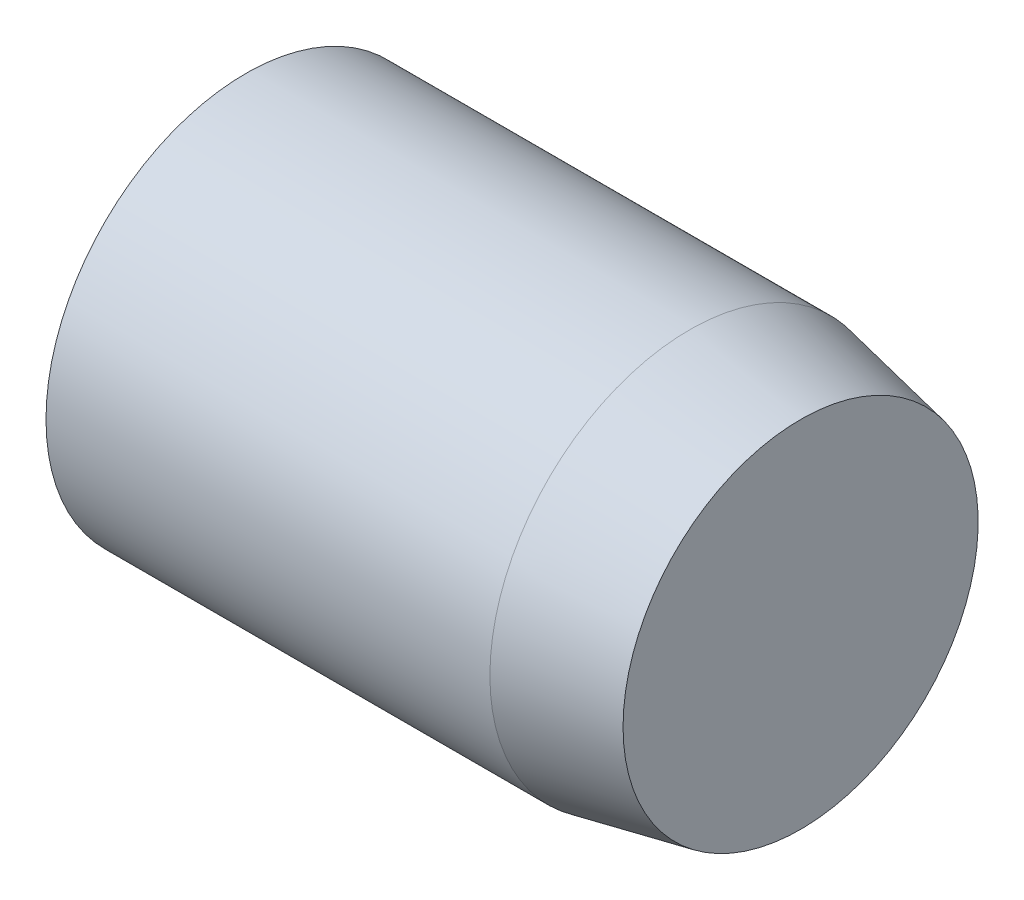
ISO-10303-21;
HEADER;
FILE_DESCRIPTION(('STEP AP214'),'2;1');
FILE_NAME('part.step','',(''),(''),'','','');
FILE_SCHEMA(('AUTOMOTIVE_DESIGN { 1 0 10303 214 1 1 1 1 }'));
ENDSEC;
DATA;
#1=APPLICATION_CONTEXT('core data for automotive mechanical design processes');
#2=APPLICATION_PROTOCOL_DEFINITION('international standard','automotive_design',2000,#1);
#3=PRODUCT_CONTEXT('',#1,'mechanical');
#4=PRODUCT('Part','Part','',(#3));
#5=PRODUCT_RELATED_PRODUCT_CATEGORY('part','',(#4));
#6=PRODUCT_DEFINITION_FORMATION('','',#4);
#7=PRODUCT_DEFINITION_CONTEXT('part definition',#1,'design');
#8=PRODUCT_DEFINITION('design','',#6,#7);
#9=PRODUCT_DEFINITION_SHAPE('','',#8);
#10=(LENGTH_UNIT() NAMED_UNIT(*) SI_UNIT(.MILLI.,.METRE.));
#11=(NAMED_UNIT(*) PLANE_ANGLE_UNIT() SI_UNIT($,.RADIAN.));
#12=(NAMED_UNIT(*) SI_UNIT($,.STERADIAN.) SOLID_ANGLE_UNIT());
#13=UNCERTAINTY_MEASURE_WITH_UNIT(LENGTH_MEASURE(1.E-05),#10,'distance_accuracy_value','');
#14=(GEOMETRIC_REPRESENTATION_CONTEXT(3) GLOBAL_UNCERTAINTY_ASSIGNED_CONTEXT((#13)) GLOBAL_UNIT_ASSIGNED_CONTEXT((#10,
#11,#12)) REPRESENTATION_CONTEXT('',''));
#15=CARTESIAN_POINT('',(0.,0.,0.));
#16=DIRECTION('',(0.,0.,1.));
#17=DIRECTION('',(1.,0.,0.));
#18=AXIS2_PLACEMENT_3D('',#15,#16,#17);
#19=CARTESIAN_POINT('',(0.,0.,0.));
#20=DIRECTION('',(-1.,0.,0.));
#21=DIRECTION('',(0.,0.,1.));
#22=AXIS2_PLACEMENT_3D('',#19,#20,#21);
#23=CYLINDRICAL_SURFACE('',#22,4.5);
#24=CARTESIAN_POINT('',(0.,0.,0.));
#25=DIRECTION('',(-1.,0.,0.));
#26=DIRECTION('',(0.,0.,1.));
#27=AXIS2_PLACEMENT_3D('',#24,#25,#26);
#28=CIRCLE('',#27,4.5);
#29=CARTESIAN_POINT('',(0.,0.,4.5));
#30=VERTEX_POINT('',#29);
#31=EDGE_CURVE('E10',#30,#30,#28,.T.);
#32=ORIENTED_EDGE('',*,*,#31,.F.);
#33=EDGE_LOOP('',(#32));
#34=FACE_BOUND('',#33,.T.);
#35=CARTESIAN_POINT('',(10.,0.,0.));
#36=DIRECTION('',(-1.,0.,0.));
#37=DIRECTION('',(0.,0.,1.));
#38=AXIS2_PLACEMENT_3D('',#35,#36,#37);
#39=CIRCLE('',#38,4.5);
#40=CARTESIAN_POINT('',(10.,0.,4.5));
#41=VERTEX_POINT('',#40);
#42=EDGE_CURVE('E49',#41,#41,#39,.T.);
#43=ORIENTED_EDGE('',*,*,#42,.T.);
#44=EDGE_LOOP('',(#43));
#45=FACE_BOUND('',#44,.T.);
#46=ADVANCED_FACE('F37',(#34,#45),#23,.T.);
#47=CARTESIAN_POINT('',(0.,0.,-4.5));
#48=DIRECTION('',(1.,0.,0.));
#49=DIRECTION('',(0.,0.,-1.));
#50=AXIS2_PLACEMENT_3D('',#47,#48,#49);
#51=PLANE('',#50);
#52=ORIENTED_EDGE('',*,*,#31,.T.);
#53=EDGE_LOOP('',(#52));
#54=FACE_BOUND('',#53,.T.);
#55=ADVANCED_FACE('F65',(#54),#51,.F.);
#56=CARTESIAN_POINT('',(12.5,0.,0.));
#57=DIRECTION('',(-1.,0.,0.));
#58=DIRECTION('',(0.,0.,1.));
#59=AXIS2_PLACEMENT_3D('',#56,#57,#58);
#60=PLANE('',#59);
#61=CARTESIAN_POINT('',(12.5,0.,0.));
#62=DIRECTION('',(-1.,0.,0.));
#63=DIRECTION('',(0.,0.,1.));
#64=AXIS2_PLACEMENT_3D('',#61,#62,#63);
#65=CIRCLE('',#64,4.);
#66=CARTESIAN_POINT('',(12.5,0.,4.));
#67=VERTEX_POINT('',#66);
#68=EDGE_CURVE('E44',#67,#67,#65,.T.);
#69=ORIENTED_EDGE('',*,*,#68,.F.);
#70=EDGE_LOOP('',(#69));
#71=FACE_BOUND('',#70,.T.);
#72=ADVANCED_FACE('F60',(#71),#60,.F.);
#73=CARTESIAN_POINT('',(12.5,0.,0.));
#74=DIRECTION('',(-1.,0.,0.));
#75=DIRECTION('',(0.,0.,1.));
#76=AXIS2_PLACEMENT_3D('',#73,#74,#75);
#77=CONICAL_SURFACE('',#76,4.,0.197395559849881);
#78=ORIENTED_EDGE('',*,*,#42,.F.);
#79=EDGE_LOOP('',(#78));
#80=FACE_BOUND('',#79,.T.);
#81=ORIENTED_EDGE('',*,*,#68,.T.);
#82=EDGE_LOOP('',(#81));
#83=FACE_BOUND('',#82,.T.);
#84=ADVANCED_FACE('F58',(#80,#83),#77,.T.);
#85=CLOSED_SHELL('',(#46,#55,#72,#84));
#86=MANIFOLD_SOLID_BREP('B2',#85);
#87=ADVANCED_BREP_SHAPE_REPRESENTATION('',(#18,#86),#14);
#88=SHAPE_DEFINITION_REPRESENTATION(#9,#87);
ENDSEC;
END-ISO-10303-21;
